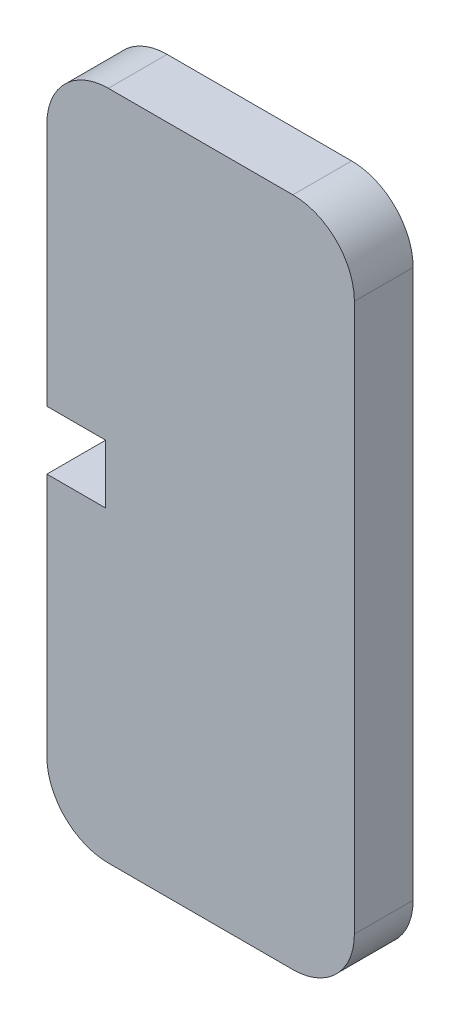
ISO-10303-21;
HEADER;
FILE_DESCRIPTION(('STEP AP214'),'2;1');
FILE_NAME('part.step','',(''),(''),'','','');
FILE_SCHEMA(('AUTOMOTIVE_DESIGN { 1 0 10303 214 1 1 1 1 }'));
ENDSEC;
DATA;
#1=APPLICATION_CONTEXT('core data for automotive mechanical design processes');
#2=APPLICATION_PROTOCOL_DEFINITION('international standard','automotive_design',2000,#1);
#3=PRODUCT_CONTEXT('',#1,'mechanical');
#4=PRODUCT('Part','Part','',(#3));
#5=PRODUCT_RELATED_PRODUCT_CATEGORY('part','',(#4));
#6=PRODUCT_DEFINITION_FORMATION('','',#4);
#7=PRODUCT_DEFINITION_CONTEXT('part definition',#1,'design');
#8=PRODUCT_DEFINITION('design','',#6,#7);
#9=PRODUCT_DEFINITION_SHAPE('','',#8);
#10=(LENGTH_UNIT() NAMED_UNIT(*) SI_UNIT(.MILLI.,.METRE.));
#11=(NAMED_UNIT(*) PLANE_ANGLE_UNIT() SI_UNIT($,.RADIAN.));
#12=(NAMED_UNIT(*) SI_UNIT($,.STERADIAN.) SOLID_ANGLE_UNIT());
#13=UNCERTAINTY_MEASURE_WITH_UNIT(LENGTH_MEASURE(1.E-05),#10,'distance_accuracy_value','');
#14=(GEOMETRIC_REPRESENTATION_CONTEXT(3) GLOBAL_UNCERTAINTY_ASSIGNED_CONTEXT((#13)) GLOBAL_UNIT_ASSIGNED_CONTEXT((#10,
#11,#12)) REPRESENTATION_CONTEXT('',''));
#15=CARTESIAN_POINT('',(0.,0.,0.));
#16=DIRECTION('',(0.,0.,1.));
#17=DIRECTION('',(1.,0.,0.));
#18=AXIS2_PLACEMENT_3D('',#15,#16,#17);
#19=CARTESIAN_POINT('',(-4.55039999999973,44.7752,4.7752));
#20=DIRECTION('',(1.,0.,0.));
#21=DIRECTION('',(0.,1.,0.));
#22=AXIS2_PLACEMENT_3D('',#19,#20,#21);
#23=PLANE('',#22);
#24=DIRECTION('',(0.,0.,1.));
#25=VECTOR('',#24,1.);
#26=CARTESIAN_POINT('',(-4.55039999999981,20.1124,0.));
#27=LINE('',#26,#25);
#28=CARTESIAN_POINT('',(-4.55039999999981,20.1124,0.));
#29=VERTEX_POINT('',#28);
#30=CARTESIAN_POINT('',(-4.55039999999981,20.1124,4.7752));
#31=VERTEX_POINT('',#30);
#32=EDGE_CURVE('E209',#29,#31,#27,.T.);
#33=ORIENTED_EDGE('',*,*,#32,.F.);
#34=DIRECTION('',(0.,-1.,0.));
#35=VECTOR('',#34,1.);
#36=CARTESIAN_POINT('',(-4.55039999999973,44.7752,0.));
#37=LINE('',#36,#35);
#38=CARTESIAN_POINT('',(-4.55039999999988,0.224799999999953,0.));
#39=VERTEX_POINT('',#38);
#40=EDGE_CURVE('E154',#29,#39,#37,.T.);
#41=ORIENTED_EDGE('',*,*,#40,.T.);
#42=DIRECTION('',(0.,0.,-1.));
#43=VECTOR('',#42,1.);
#44=CARTESIAN_POINT('',(-4.55039999999988,0.224799999999953,4.7752));
#45=LINE('',#44,#43);
#46=CARTESIAN_POINT('',(-4.55039999999988,0.224799999999953,4.7752));
#47=VERTEX_POINT('',#46);
#48=EDGE_CURVE('E49',#47,#39,#45,.T.);
#49=ORIENTED_EDGE('',*,*,#48,.F.);
#50=DIRECTION('',(0.,-1.,0.));
#51=VECTOR('',#50,1.);
#52=CARTESIAN_POINT('',(-4.55039999999973,44.7752,4.7752));
#53=LINE('',#52,#51);
#54=EDGE_CURVE('E207',#31,#47,#53,.T.);
#55=ORIENTED_EDGE('',*,*,#54,.F.);
#56=EDGE_LOOP('',(#33,#41,#49,#55));
#57=FACE_BOUND('',#56,.T.);
#58=ADVANCED_FACE('F41',(#57),#23,.F.);
#59=CARTESIAN_POINT('',(0.449600000000273,44.7751999999999,4.7752));
#60=DIRECTION('',(0.,0.,-1.));
#61=DIRECTION('',(-1.,0.,0.));
#62=AXIS2_PLACEMENT_3D('',#59,#60,#61);
#63=CYLINDRICAL_SURFACE('',#62,5.);
#64=CARTESIAN_POINT('',(0.449600000000273,44.7751999999999,0.));
#65=DIRECTION('',(0.,0.,1.));
#66=DIRECTION('',(-1.,0.,0.));
#67=AXIS2_PLACEMENT_3D('',#64,#65,#66);
#68=CIRCLE('',#67,5.);
#69=CARTESIAN_POINT('',(0.449600000000274,49.7751999999999,0.));
#70=VERTEX_POINT('',#69);
#71=CARTESIAN_POINT('',(-4.55039999999973,44.7752,0.));
#72=VERTEX_POINT('',#71);
#73=EDGE_CURVE('E151',#70,#72,#68,.T.);
#74=ORIENTED_EDGE('',*,*,#73,.T.);
#75=DIRECTION('',(0.,0.,-1.));
#76=VECTOR('',#75,1.);
#77=CARTESIAN_POINT('',(-4.55039999999973,44.7752,4.7752));
#78=LINE('',#77,#76);
#79=CARTESIAN_POINT('',(-4.55039999999973,44.7752,4.7752));
#80=VERTEX_POINT('',#79);
#81=EDGE_CURVE('E11',#80,#72,#78,.T.);
#82=ORIENTED_EDGE('',*,*,#81,.F.);
#83=CARTESIAN_POINT('',(0.449600000000273,44.7751999999999,4.7752));
#84=DIRECTION('',(0.,0.,1.));
#85=DIRECTION('',(-1.,0.,0.));
#86=AXIS2_PLACEMENT_3D('',#83,#84,#85);
#87=CIRCLE('',#86,5.);
#88=CARTESIAN_POINT('',(0.449600000000274,49.7751999999999,4.7752));
#89=VERTEX_POINT('',#88);
#90=EDGE_CURVE('E169',#89,#80,#87,.T.);
#91=ORIENTED_EDGE('',*,*,#90,.F.);
#92=DIRECTION('',(0.,0.,-1.));
#93=VECTOR('',#92,1.);
#94=CARTESIAN_POINT('',(0.449600000000274,49.7751999999999,4.7752));
#95=LINE('',#94,#93);
#96=EDGE_CURVE('E147',#89,#70,#95,.T.);
#97=ORIENTED_EDGE('',*,*,#96,.T.);
#98=EDGE_LOOP('',(#74,#82,#91,#97));
#99=FACE_BOUND('',#98,.T.);
#100=ADVANCED_FACE('F43',(#99),#63,.T.);
#101=CARTESIAN_POINT('',(-4.5503999999998,24.8876,0.));
#102=VERTEX_POINT('',#101);
#103=EDGE_CURVE('E156',#72,#102,#37,.T.);
#104=ORIENTED_EDGE('',*,*,#103,.T.);
#105=DIRECTION('',(0.,0.,1.));
#106=VECTOR('',#105,1.);
#107=CARTESIAN_POINT('',(-4.5503999999998,24.8876,0.));
#108=LINE('',#107,#106);
#109=CARTESIAN_POINT('',(-4.5503999999998,24.8876,4.7752));
#110=VERTEX_POINT('',#109);
#111=EDGE_CURVE('E155',#102,#110,#108,.T.);
#112=ORIENTED_EDGE('',*,*,#111,.T.);
#113=EDGE_CURVE('E106',#80,#110,#53,.T.);
#114=ORIENTED_EDGE('',*,*,#113,.F.);
#115=ORIENTED_EDGE('',*,*,#81,.T.);
#116=EDGE_LOOP('',(#104,#112,#114,#115));
#117=FACE_BOUND('',#116,.T.);
#118=ADVANCED_FACE('F253',(#117),#23,.F.);
#119=CARTESIAN_POINT('',(0.449600000000116,0.224799999999933,4.7752));
#120=DIRECTION('',(0.,0.,-1.));
#121=DIRECTION('',(-1.,0.,0.));
#122=AXIS2_PLACEMENT_3D('',#119,#120,#121);
#123=CYLINDRICAL_SURFACE('',#122,5.);
#124=CARTESIAN_POINT('',(0.449600000000116,0.224799999999933,0.));
#125=DIRECTION('',(0.,0.,1.));
#126=DIRECTION('',(1.,0.,0.));
#127=AXIS2_PLACEMENT_3D('',#124,#125,#126);
#128=CIRCLE('',#127,5.);
#129=CARTESIAN_POINT('',(0.449600000000115,-4.77520000000007,0.));
#130=VERTEX_POINT('',#129);
#131=EDGE_CURVE('E159',#39,#130,#128,.T.);
#132=ORIENTED_EDGE('',*,*,#131,.T.);
#133=DIRECTION('',(0.,0.,-1.));
#134=VECTOR('',#133,1.);
#135=CARTESIAN_POINT('',(0.449600000000115,-4.77520000000007,4.7752));
#136=LINE('',#135,#134);
#137=CARTESIAN_POINT('',(0.449600000000115,-4.77520000000007,4.7752));
#138=VERTEX_POINT('',#137);
#139=EDGE_CURVE('E176',#138,#130,#136,.T.);
#140=ORIENTED_EDGE('',*,*,#139,.F.);
#141=CARTESIAN_POINT('',(0.449600000000116,0.224799999999933,4.7752));
#142=DIRECTION('',(0.,0.,1.));
#143=DIRECTION('',(1.,0.,0.));
#144=AXIS2_PLACEMENT_3D('',#141,#142,#143);
#145=CIRCLE('',#144,5.);
#146=EDGE_CURVE('E185',#47,#138,#145,.T.);
#147=ORIENTED_EDGE('',*,*,#146,.F.);
#148=ORIENTED_EDGE('',*,*,#48,.T.);
#149=EDGE_LOOP('',(#132,#140,#147,#148));
#150=FACE_BOUND('',#149,.T.);
#151=ADVANCED_FACE('F183',(#150),#123,.T.);
#152=CARTESIAN_POINT('',(0.449600000000116,-4.77520000000007,4.7752));
#153=DIRECTION('',(0.,1.,0.));
#154=DIRECTION('',(0.,0.,1.));
#155=AXIS2_PLACEMENT_3D('',#152,#153,#154);
#156=PLANE('',#155);
#157=DIRECTION('',(1.,0.,0.));
#158=VECTOR('',#157,1.);
#159=CARTESIAN_POINT('',(0.449600000000116,-4.77520000000007,0.));
#160=LINE('',#159,#158);
#161=CARTESIAN_POINT('',(15.4496000000001,-4.77520000000007,0.));
#162=VERTEX_POINT('',#161);
#163=EDGE_CURVE('E161',#130,#162,#160,.T.);
#164=ORIENTED_EDGE('',*,*,#163,.T.);
#165=DIRECTION('',(0.,0.,-1.));
#166=VECTOR('',#165,1.);
#167=CARTESIAN_POINT('',(15.4496000000001,-4.77520000000007,4.7752));
#168=LINE('',#167,#166);
#169=CARTESIAN_POINT('',(15.4496000000001,-4.77520000000007,4.7752));
#170=VERTEX_POINT('',#169);
#171=EDGE_CURVE('E173',#170,#162,#168,.T.);
#172=ORIENTED_EDGE('',*,*,#171,.F.);
#173=DIRECTION('',(1.,0.,0.));
#174=VECTOR('',#173,1.);
#175=CARTESIAN_POINT('',(0.449600000000116,-4.77520000000007,4.7752));
#176=LINE('',#175,#174);
#177=EDGE_CURVE('E202',#138,#170,#176,.T.);
#178=ORIENTED_EDGE('',*,*,#177,.F.);
#179=ORIENTED_EDGE('',*,*,#139,.T.);
#180=EDGE_LOOP('',(#164,#172,#178,#179));
#181=FACE_BOUND('',#180,.T.);
#182=ADVANCED_FACE('F198',(#181),#156,.F.);
#183=CARTESIAN_POINT('',(15.4496000000001,0.224799999999935,4.7752));
#184=DIRECTION('',(0.,0.,-1.));
#185=DIRECTION('',(-1.,0.,0.));
#186=AXIS2_PLACEMENT_3D('',#183,#184,#185);
#187=CYLINDRICAL_SURFACE('',#186,5.);
#188=CARTESIAN_POINT('',(15.4496000000001,0.224799999999935,0.));
#189=DIRECTION('',(0.,0.,1.));
#190=DIRECTION('',(1.,0.,0.));
#191=AXIS2_PLACEMENT_3D('',#188,#189,#190);
#192=CIRCLE('',#191,5.);
#193=CARTESIAN_POINT('',(20.4496000000001,0.224799999999935,0.));
#194=VERTEX_POINT('',#193);
#195=EDGE_CURVE('E163',#162,#194,#192,.T.);
#196=ORIENTED_EDGE('',*,*,#195,.T.);
#197=DIRECTION('',(0.,0.,-1.));
#198=VECTOR('',#197,1.);
#199=CARTESIAN_POINT('',(20.4496000000001,0.224799999999935,4.7752));
#200=LINE('',#199,#198);
#201=CARTESIAN_POINT('',(20.4496000000001,0.224799999999935,4.7752));
#202=VERTEX_POINT('',#201);
#203=EDGE_CURVE('E142',#202,#194,#200,.T.);
#204=ORIENTED_EDGE('',*,*,#203,.F.);
#205=CARTESIAN_POINT('',(15.4496000000001,0.224799999999935,4.7752));
#206=DIRECTION('',(0.,0.,1.));
#207=DIRECTION('',(1.,0.,0.));
#208=AXIS2_PLACEMENT_3D('',#205,#206,#207);
#209=CIRCLE('',#208,5.);
#210=EDGE_CURVE('E130',#170,#202,#209,.T.);
#211=ORIENTED_EDGE('',*,*,#210,.F.);
#212=ORIENTED_EDGE('',*,*,#171,.T.);
#213=EDGE_LOOP('',(#196,#204,#211,#212));
#214=FACE_BOUND('',#213,.T.);
#215=ADVANCED_FACE('F201',(#214),#187,.T.);
#216=CARTESIAN_POINT('',(20.4496000000003,44.7751999999999,4.7752));
#217=DIRECTION('',(-1.,0.,0.));
#218=DIRECTION('',(0.,-1.,0.));
#219=AXIS2_PLACEMENT_3D('',#216,#217,#218);
#220=PLANE('',#219);
#221=DIRECTION('',(0.,1.,0.));
#222=VECTOR('',#221,1.);
#223=CARTESIAN_POINT('',(20.4496000000003,44.7751999999999,0.));
#224=LINE('',#223,#222);
#225=CARTESIAN_POINT('',(20.4496000000003,44.7751999999999,0.));
#226=VERTEX_POINT('',#225);
#227=EDGE_CURVE('E139',#194,#226,#224,.T.);
#228=ORIENTED_EDGE('',*,*,#227,.T.);
#229=DIRECTION('',(0.,0.,-1.));
#230=VECTOR('',#229,1.);
#231=CARTESIAN_POINT('',(20.4496000000003,44.7751999999999,4.7752));
#232=LINE('',#231,#230);
#233=CARTESIAN_POINT('',(20.4496000000003,44.7751999999999,4.7752));
#234=VERTEX_POINT('',#233);
#235=EDGE_CURVE('E136',#234,#226,#232,.T.);
#236=ORIENTED_EDGE('',*,*,#235,.F.);
#237=DIRECTION('',(0.,1.,0.));
#238=VECTOR('',#237,1.);
#239=CARTESIAN_POINT('',(20.4496000000003,44.7751999999999,4.7752));
#240=LINE('',#239,#238);
#241=EDGE_CURVE('E123',#202,#234,#240,.T.);
#242=ORIENTED_EDGE('',*,*,#241,.F.);
#243=ORIENTED_EDGE('',*,*,#203,.T.);
#244=EDGE_LOOP('',(#228,#236,#242,#243));
#245=FACE_BOUND('',#244,.T.);
#246=ADVANCED_FACE('F137',(#245),#220,.F.);
#247=CARTESIAN_POINT('',(15.4496000000003,44.7751999999999,4.7752));
#248=DIRECTION('',(0.,0.,-1.));
#249=DIRECTION('',(-1.,0.,0.));
#250=AXIS2_PLACEMENT_3D('',#247,#248,#249);
#251=CYLINDRICAL_SURFACE('',#250,5.);
#252=CARTESIAN_POINT('',(15.4496000000003,44.7751999999999,0.));
#253=DIRECTION('',(0.,0.,1.));
#254=DIRECTION('',(-1.,0.,0.));
#255=AXIS2_PLACEMENT_3D('',#252,#253,#254);
#256=CIRCLE('',#255,5.);
#257=CARTESIAN_POINT('',(15.4496000000003,49.7751999999999,0.));
#258=VERTEX_POINT('',#257);
#259=EDGE_CURVE('E166',#226,#258,#256,.T.);
#260=ORIENTED_EDGE('',*,*,#259,.T.);
#261=DIRECTION('',(0.,0.,-1.));
#262=VECTOR('',#261,1.);
#263=CARTESIAN_POINT('',(15.4496000000003,49.7751999999999,4.7752));
#264=LINE('',#263,#262);
#265=CARTESIAN_POINT('',(15.4496000000003,49.7751999999999,4.7752));
#266=VERTEX_POINT('',#265);
#267=EDGE_CURVE('E143',#266,#258,#264,.T.);
#268=ORIENTED_EDGE('',*,*,#267,.F.);
#269=CARTESIAN_POINT('',(15.4496000000003,44.7751999999999,4.7752));
#270=DIRECTION('',(0.,0.,1.));
#271=DIRECTION('',(-1.,0.,0.));
#272=AXIS2_PLACEMENT_3D('',#269,#270,#271);
#273=CIRCLE('',#272,5.);
#274=EDGE_CURVE('E127',#234,#266,#273,.T.);
#275=ORIENTED_EDGE('',*,*,#274,.F.);
#276=ORIENTED_EDGE('',*,*,#235,.T.);
#277=EDGE_LOOP('',(#260,#268,#275,#276));
#278=FACE_BOUND('',#277,.T.);
#279=ADVANCED_FACE('F145',(#278),#251,.T.);
#280=CARTESIAN_POINT('',(0.449600000000274,49.7751999999999,4.7752));
#281=DIRECTION('',(0.,-1.,0.));
#282=DIRECTION('',(0.,0.,-1.));
#283=AXIS2_PLACEMENT_3D('',#280,#281,#282);
#284=PLANE('',#283);
#285=DIRECTION('',(-1.,0.,0.));
#286=VECTOR('',#285,1.);
#287=CARTESIAN_POINT('',(0.449600000000274,49.7751999999999,0.));
#288=LINE('',#287,#286);
#289=EDGE_CURVE('E98',#258,#70,#288,.T.);
#290=ORIENTED_EDGE('',*,*,#289,.T.);
#291=ORIENTED_EDGE('',*,*,#96,.F.);
#292=DIRECTION('',(-1.,0.,0.));
#293=VECTOR('',#292,1.);
#294=CARTESIAN_POINT('',(0.449600000000274,49.7751999999999,4.7752));
#295=LINE('',#294,#293);
#296=EDGE_CURVE('E65',#266,#89,#295,.T.);
#297=ORIENTED_EDGE('',*,*,#296,.F.);
#298=ORIENTED_EDGE('',*,*,#267,.T.);
#299=EDGE_LOOP('',(#290,#291,#297,#298));
#300=FACE_BOUND('',#299,.T.);
#301=ADVANCED_FACE('F257',(#300),#284,.F.);
#302=CARTESIAN_POINT('',(0.449600000000273,44.7751999999999,4.7752));
#303=DIRECTION('',(0.,0.,-1.));
#304=DIRECTION('',(-1.,0.,0.));
#305=AXIS2_PLACEMENT_3D('',#302,#303,#304);
#306=PLANE('',#305);
#307=ORIENTED_EDGE('',*,*,#113,.T.);
#308=DIRECTION('',(-1.,0.,0.));
#309=VECTOR('',#308,1.);
#310=CARTESIAN_POINT('',(0.,24.8876,4.7752));
#311=LINE('',#310,#309);
#312=CARTESIAN_POINT('',(0.224800000000277,24.8876,4.7752));
#313=VERTEX_POINT('',#312);
#314=EDGE_CURVE('E219',#313,#110,#311,.T.);
#315=ORIENTED_EDGE('',*,*,#314,.F.);
#316=DIRECTION('',(0.,1.,0.));
#317=VECTOR('',#316,1.);
#318=CARTESIAN_POINT('',(0.224800000000277,0.,4.7752));
#319=LINE('',#318,#317);
#320=CARTESIAN_POINT('',(0.224800000000277,20.1124,4.7752));
#321=VERTEX_POINT('',#320);
#322=EDGE_CURVE('E223',#321,#313,#319,.T.);
#323=ORIENTED_EDGE('',*,*,#322,.F.);
#324=DIRECTION('',(-1.,0.,0.));
#325=VECTOR('',#324,1.);
#326=CARTESIAN_POINT('',(0.,20.1124,4.7752));
#327=LINE('',#326,#325);
#328=EDGE_CURVE('E226',#321,#31,#327,.T.);
#329=ORIENTED_EDGE('',*,*,#328,.T.);
#330=ORIENTED_EDGE('',*,*,#54,.T.);
#331=ORIENTED_EDGE('',*,*,#146,.T.);
#332=ORIENTED_EDGE('',*,*,#177,.T.);
#333=ORIENTED_EDGE('',*,*,#210,.T.);
#334=ORIENTED_EDGE('',*,*,#241,.T.);
#335=ORIENTED_EDGE('',*,*,#274,.T.);
#336=ORIENTED_EDGE('',*,*,#296,.T.);
#337=ORIENTED_EDGE('',*,*,#90,.T.);
#338=EDGE_LOOP('',(#307,#315,#323,#329,#330,#331,#332,#333,#334,#335,#336,#337));
#339=FACE_BOUND('',#338,.T.);
#340=ADVANCED_FACE('F125',(#339),#306,.F.);
#341=CARTESIAN_POINT('',(0.449600000000273,44.7751999999999,0.));
#342=DIRECTION('',(0.,0.,-1.));
#343=DIRECTION('',(-1.,0.,0.));
#344=AXIS2_PLACEMENT_3D('',#341,#342,#343);
#345=PLANE('',#344);
#346=DIRECTION('',(-1.,0.,0.));
#347=VECTOR('',#346,1.);
#348=CARTESIAN_POINT('',(0.,24.8876,0.));
#349=LINE('',#348,#347);
#350=CARTESIAN_POINT('',(0.224800000000277,24.8876,0.));
#351=VERTEX_POINT('',#350);
#352=EDGE_CURVE('E213',#351,#102,#349,.T.);
#353=ORIENTED_EDGE('',*,*,#352,.T.);
#354=ORIENTED_EDGE('',*,*,#103,.F.);
#355=ORIENTED_EDGE('',*,*,#73,.F.);
#356=ORIENTED_EDGE('',*,*,#289,.F.);
#357=ORIENTED_EDGE('',*,*,#259,.F.);
#358=ORIENTED_EDGE('',*,*,#227,.F.);
#359=ORIENTED_EDGE('',*,*,#195,.F.);
#360=ORIENTED_EDGE('',*,*,#163,.F.);
#361=ORIENTED_EDGE('',*,*,#131,.F.);
#362=ORIENTED_EDGE('',*,*,#40,.F.);
#363=DIRECTION('',(-1.,0.,0.));
#364=VECTOR('',#363,1.);
#365=CARTESIAN_POINT('',(0.,20.1124,0.));
#366=LINE('',#365,#364);
#367=CARTESIAN_POINT('',(0.224800000000277,20.1124,0.));
#368=VERTEX_POINT('',#367);
#369=EDGE_CURVE('E222',#368,#29,#366,.T.);
#370=ORIENTED_EDGE('',*,*,#369,.F.);
#371=DIRECTION('',(0.,1.,0.));
#372=VECTOR('',#371,1.);
#373=CARTESIAN_POINT('',(0.224800000000277,0.,0.));
#374=LINE('',#373,#372);
#375=EDGE_CURVE('E56',#368,#351,#374,.T.);
#376=ORIENTED_EDGE('',*,*,#375,.T.);
#377=EDGE_LOOP('',(#353,#354,#355,#356,#357,#358,#359,#360,#361,#362,#370,#376));
#378=FACE_BOUND('',#377,.T.);
#379=ADVANCED_FACE('F192',(#378),#345,.T.);
#380=CARTESIAN_POINT('',(0.,24.8876,0.));
#381=DIRECTION('',(0.,1.,0.));
#382=DIRECTION('',(0.,0.,1.));
#383=AXIS2_PLACEMENT_3D('',#380,#381,#382);
#384=PLANE('',#383);
#385=ORIENTED_EDGE('',*,*,#314,.T.);
#386=ORIENTED_EDGE('',*,*,#111,.F.);
#387=ORIENTED_EDGE('',*,*,#352,.F.);
#388=DIRECTION('',(0.,0.,1.));
#389=VECTOR('',#388,1.);
#390=CARTESIAN_POINT('',(0.224800000000277,24.8876,0.));
#391=LINE('',#390,#389);
#392=EDGE_CURVE('E215',#351,#313,#391,.T.);
#393=ORIENTED_EDGE('',*,*,#392,.T.);
#394=EDGE_LOOP('',(#385,#386,#387,#393));
#395=FACE_BOUND('',#394,.T.);
#396=ADVANCED_FACE('F251',(#395),#384,.F.);
#397=CARTESIAN_POINT('',(0.224800000000277,0.,0.));
#398=DIRECTION('',(1.,0.,0.));
#399=DIRECTION('',(0.,0.,-1.));
#400=AXIS2_PLACEMENT_3D('',#397,#398,#399);
#401=PLANE('',#400);
#402=ORIENTED_EDGE('',*,*,#322,.T.);
#403=ORIENTED_EDGE('',*,*,#392,.F.);
#404=ORIENTED_EDGE('',*,*,#375,.F.);
#405=DIRECTION('',(0.,0.,1.));
#406=VECTOR('',#405,1.);
#407=CARTESIAN_POINT('',(0.224800000000277,20.1124,0.));
#408=LINE('',#407,#406);
#409=EDGE_CURVE('E212',#368,#321,#408,.T.);
#410=ORIENTED_EDGE('',*,*,#409,.T.);
#411=EDGE_LOOP('',(#402,#403,#404,#410));
#412=FACE_BOUND('',#411,.T.);
#413=ADVANCED_FACE('F249',(#412),#401,.F.);
#414=CARTESIAN_POINT('',(0.,20.1124,0.));
#415=DIRECTION('',(0.,1.,0.));
#416=DIRECTION('',(0.,0.,1.));
#417=AXIS2_PLACEMENT_3D('',#414,#415,#416);
#418=PLANE('',#417);
#419=ORIENTED_EDGE('',*,*,#328,.F.);
#420=ORIENTED_EDGE('',*,*,#409,.F.);
#421=ORIENTED_EDGE('',*,*,#369,.T.);
#422=ORIENTED_EDGE('',*,*,#32,.T.);
#423=EDGE_LOOP('',(#419,#420,#421,#422));
#424=FACE_BOUND('',#423,.T.);
#425=ADVANCED_FACE('F235',(#424),#418,.T.);
#426=CLOSED_SHELL('',(#58,#100,#118,#151,#182,#215,#246,#279,#301,#340,#379,#396,#413,#425));
#427=MANIFOLD_SOLID_BREP('B2',#426);
#428=ADVANCED_BREP_SHAPE_REPRESENTATION('',(#18,#427),#14);
#429=SHAPE_DEFINITION_REPRESENTATION(#9,#428);
ENDSEC;
END-ISO-10303-21;
